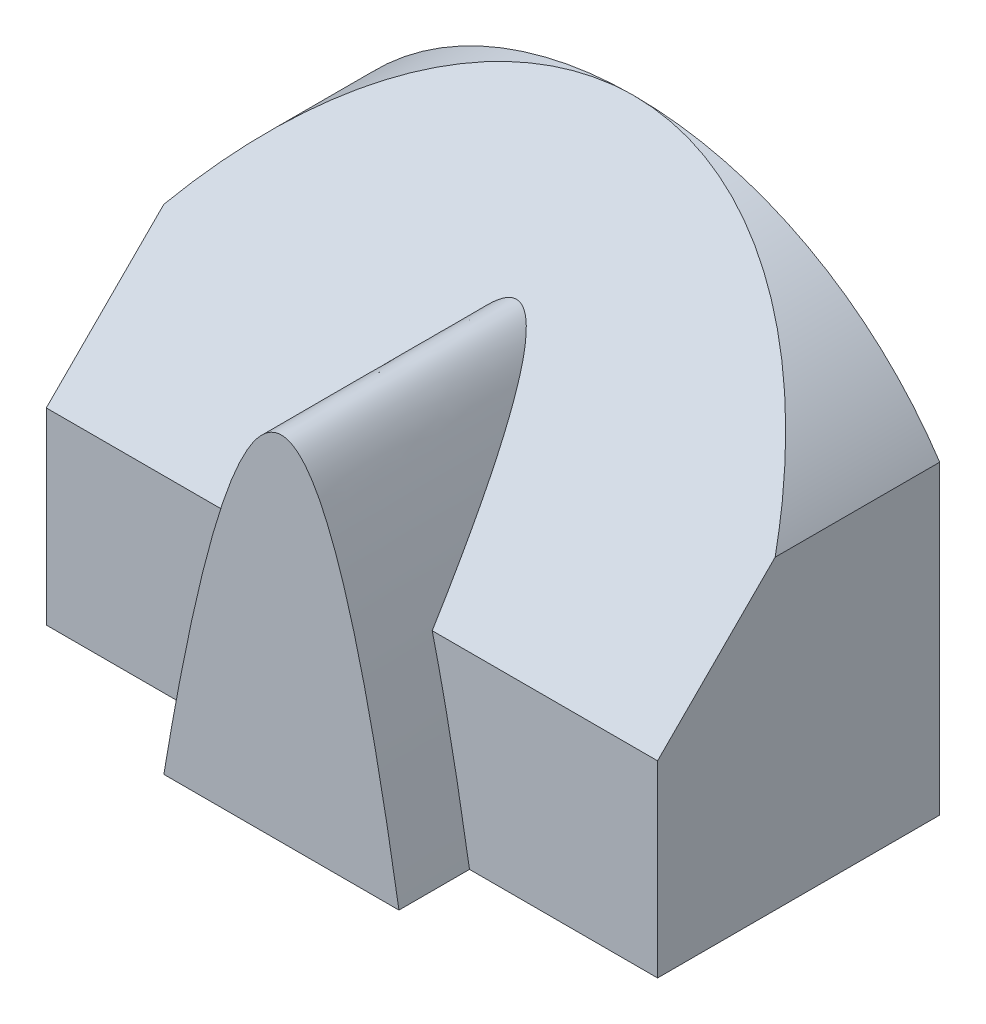
ISO-10303-21;
HEADER;
FILE_DESCRIPTION(('STEP AP214'),'2;1');
FILE_NAME('part.step','',(''),(''),'','','');
FILE_SCHEMA(('AUTOMOTIVE_DESIGN { 1 0 10303 214 1 1 1 1 }'));
ENDSEC;
DATA;
#1=APPLICATION_CONTEXT('core data for automotive mechanical design processes');
#2=APPLICATION_PROTOCOL_DEFINITION('international standard','automotive_design',2000,#1);
#3=PRODUCT_CONTEXT('',#1,'mechanical');
#4=PRODUCT('Part','Part','',(#3));
#5=PRODUCT_RELATED_PRODUCT_CATEGORY('part','',(#4));
#6=PRODUCT_DEFINITION_FORMATION('','',#4);
#7=PRODUCT_DEFINITION_CONTEXT('part definition',#1,'design');
#8=PRODUCT_DEFINITION('design','',#6,#7);
#9=PRODUCT_DEFINITION_SHAPE('','',#8);
#10=(LENGTH_UNIT() NAMED_UNIT(*) SI_UNIT(.MILLI.,.METRE.));
#11=(NAMED_UNIT(*) PLANE_ANGLE_UNIT() SI_UNIT($,.RADIAN.));
#12=(NAMED_UNIT(*) SI_UNIT($,.STERADIAN.) SOLID_ANGLE_UNIT());
#13=UNCERTAINTY_MEASURE_WITH_UNIT(LENGTH_MEASURE(1.E-05),#10,'distance_accuracy_value','');
#14=(GEOMETRIC_REPRESENTATION_CONTEXT(3) GLOBAL_UNCERTAINTY_ASSIGNED_CONTEXT((#13)) GLOBAL_UNIT_ASSIGNED_CONTEXT((#10,
#11,#12)) REPRESENTATION_CONTEXT('',''));
#15=CARTESIAN_POINT('',(0.,0.,0.));
#16=DIRECTION('',(0.,0.,1.));
#17=DIRECTION('',(1.,0.,0.));
#18=AXIS2_PLACEMENT_3D('',#15,#16,#17);
#19=CARTESIAN_POINT('',(0.,100.,0.));
#20=DIRECTION('',(0.,0.,-1.));
#21=DIRECTION('',(-1.,0.,0.));
#22=AXIS2_PLACEMENT_3D('',#19,#20,#21);
#23=PLANE('',#22);
#24=CARTESIAN_POINT('',(1355.99444873713,-199925.,0.));
#25=CARTESIAN_POINT('',(64.9999999986677,200075.,0.));
#26=CARTESIAN_POINT('',(-1225.99444873447,-199925.,0.));
#27=B_SPLINE_CURVE_WITH_KNOTS('',2,(#24,#25,#26),.UNSPECIFIED.,.F.,.F.,(3,3),(0.,1.),.UNSPECIFIED.);
#28=CARTESIAN_POINT('',(90.,0.,0.));
#29=VERTEX_POINT('',#28);
#30=CARTESIAN_POINT('',(82.0782512765948,40.,0.));
#31=VERTEX_POINT('',#30);
#32=EDGE_CURVE('E50',#29,#31,#27,.T.);
#33=ORIENTED_EDGE('',*,*,#32,.F.);
#34=DIRECTION('',(1.,0.,0.));
#35=VECTOR('',#34,1.);
#36=CARTESIAN_POINT('',(0.,0.,0.));
#37=LINE('',#36,#35);
#38=CARTESIAN_POINT('',(130.,0.,0.));
#39=VERTEX_POINT('',#38);
#40=EDGE_CURVE('E150',#29,#39,#37,.T.);
#41=ORIENTED_EDGE('',*,*,#40,.T.);
#42=DIRECTION('',(0.,1.,0.));
#43=VECTOR('',#42,1.);
#44=CARTESIAN_POINT('',(130.,0.,0.));
#45=LINE('',#44,#43);
#46=CARTESIAN_POINT('',(130.,40.,0.));
#47=VERTEX_POINT('',#46);
#48=EDGE_CURVE('E152',#39,#47,#45,.T.);
#49=ORIENTED_EDGE('',*,*,#48,.T.);
#50=DIRECTION('',(1.,0.,0.));
#51=VECTOR('',#50,1.);
#52=CARTESIAN_POINT('',(0.,40.,0.));
#53=LINE('',#52,#51);
#54=EDGE_CURVE('E135',#31,#47,#53,.T.);
#55=ORIENTED_EDGE('',*,*,#54,.F.);
#56=EDGE_LOOP('',(#33,#41,#49,#55));
#57=FACE_BOUND('',#56,.T.);
#58=ADVANCED_FACE('F30',(#57),#23,.F.);
#59=CARTESIAN_POINT('',(47.9217487234054,39.9999999999999,0.));
#60=VERTEX_POINT('',#59);
#61=CARTESIAN_POINT('',(40.,0.,0.));
#62=VERTEX_POINT('',#61);
#63=EDGE_CURVE('E120',#60,#62,#27,.T.);
#64=ORIENTED_EDGE('',*,*,#63,.F.);
#65=CARTESIAN_POINT('',(0.,40.,0.));
#66=VERTEX_POINT('',#65);
#67=EDGE_CURVE('E136',#66,#60,#53,.T.);
#68=ORIENTED_EDGE('',*,*,#67,.F.);
#69=DIRECTION('',(0.,-1.,0.));
#70=VECTOR('',#69,1.);
#71=CARTESIAN_POINT('',(0.,0.,0.));
#72=LINE('',#71,#70);
#73=CARTESIAN_POINT('',(0.,0.,0.));
#74=VERTEX_POINT('',#73);
#75=EDGE_CURVE('E146',#66,#74,#72,.T.);
#76=ORIENTED_EDGE('',*,*,#75,.T.);
#77=EDGE_CURVE('E58',#74,#62,#37,.T.);
#78=ORIENTED_EDGE('',*,*,#77,.T.);
#79=EDGE_LOOP('',(#64,#68,#76,#78));
#80=FACE_BOUND('',#79,.T.);
#81=ADVANCED_FACE('F193',(#80),#23,.F.);
#82=CARTESIAN_POINT('',(0.,40.,0.));
#83=DIRECTION('',(0.,-0.707106781186547,-0.707106781186548));
#84=DIRECTION('',(0.,0.707106781186548,-0.707106781186547));
#85=AXIS2_PLACEMENT_3D('',#82,#83,#84);
#86=PLANE('',#85);
#87=CARTESIAN_POINT('',(82.0782512765948,40.0000000000004,0.));
#88=CARTESIAN_POINT('',(81.9394076010281,40.5690652231404,-0.569065223140225));
#89=CARTESIAN_POINT('',(81.7989308451484,41.1379321636951,-1.13793216369506));
#90=CARTESIAN_POINT('',(81.5143614052626,42.2755414066527,-2.27554140665272));
#91=CARTESIAN_POINT('',(81.370266744169,42.844283461693,-2.84428346169306));
#92=CARTESIAN_POINT('',(81.0782040630542,43.9815210742126,-3.98152107421255));
#93=CARTESIAN_POINT('',(80.9302344175088,44.5500164231543,-4.55001642315425));
#94=CARTESIAN_POINT('',(80.6301182172563,45.6866320713027,-5.68663207130275));
#95=CARTESIAN_POINT('',(80.4779704256707,46.2547522073337,-6.25475220733373));
#96=CARTESIAN_POINT('',(80.1691513509301,47.3904834012959,-7.3904834012959));
#97=CARTESIAN_POINT('',(80.0124792631676,47.9580943499344,-7.95809434993444));
#98=CARTESIAN_POINT('',(79.6942090786773,49.092665715651,-9.09266571565098));
#99=CARTESIAN_POINT('',(79.5326106506704,49.6596260863079,-9.65962608630792));
#100=CARTESIAN_POINT('',(79.2007067171921,50.8041629623934,-10.8041629623934));
#101=CARTESIAN_POINT('',(79.0302914465827,51.3817235722529,-11.3817235722529));
#102=CARTESIAN_POINT('',(78.6832490600873,52.5358567827792,-12.5358567827792));
#103=CARTESIAN_POINT('',(78.5066225154146,53.1124294692115,-13.1124294692114));
#104=CARTESIAN_POINT('',(78.1464467354901,54.2644045010577,-14.2644045010578));
#105=CARTESIAN_POINT('',(77.9628985326279,54.8398070076205,-14.8398070076209));
#106=CARTESIAN_POINT('',(77.5880172575126,55.9892351293024,-15.9892351293021));
#107=CARTESIAN_POINT('',(77.3966856048037,56.563260975453,-16.5632609754517));
#108=CARTESIAN_POINT('',(77.0051734405386,57.7096955323516,-17.7096955323529));
#109=CARTESIAN_POINT('',(76.8049945212338,58.2821045145188,-18.2821045145237));
#110=CARTESIAN_POINT('',(76.3944555461301,59.4250264792013,-19.4250264791964));
#111=CARTESIAN_POINT('',(76.184096747222,59.9955396865361,-19.9955396865178));
#112=CARTESIAN_POINT('',(75.8386471890264,60.9048441438415,-20.9048441438297));
#113=CARTESIAN_POINT('',(75.7073871570479,61.2443638669723,-21.2443638669692));
#114=CARTESIAN_POINT('',(75.4401662307156,61.9224952757694,-21.9224952757726));
#115=CARTESIAN_POINT('',(75.3042051252435,62.2611069199174,-22.2611069199183));
#116=CARTESIAN_POINT('',(75.0270437571106,62.9373122131368,-22.9373122131359));
#117=CARTESIAN_POINT('',(74.8858427224606,63.27490570422,-23.2749057042197));
#118=CARTESIAN_POINT('',(74.5975486758207,63.9489418733196,-23.9489418733198));
#119=CARTESIAN_POINT('',(74.4504539625309,64.285384188165,-24.2853841881651));
#120=CARTESIAN_POINT('',(74.1495733622425,64.956954823527,-24.956954823527));
#121=CARTESIAN_POINT('',(73.9957842183821,65.2920824160146,-25.2920824160146));
#122=CARTESIAN_POINT('',(73.6813487752288,65.9590557570852,-25.9590557570852));
#123=CARTESIAN_POINT('',(73.5207364207926,66.2909094867718,-26.2909094867718));
#124=CARTESIAN_POINT('',(73.1908438566731,66.9524755910257,-26.9524755910257));
#125=CARTESIAN_POINT('',(73.0215633364035,67.2821878883865,-27.2821878883865));
#126=CARTESIAN_POINT('',(72.6729265637176,67.9387913172644,-27.9387913172644));
#127=CARTESIAN_POINT('',(72.4935745744914,68.2656835758888,-28.2656835758888));
#128=CARTESIAN_POINT('',(72.1229025472214,68.9158322168029,-28.9158322168029));
#129=CARTESIAN_POINT('',(71.9315901089056,69.239090756956,-29.239090756956));
#130=CARTESIAN_POINT('',(71.5343703670718,69.8809837463807,-29.8809837463806));
#131=CARTESIAN_POINT('',(71.3284687881813,70.1996199509273,-30.1996199509272));
#132=CARTESIAN_POINT('',(70.9690832296538,70.7268970326306,-30.7268970326304));
#133=CARTESIAN_POINT('',(70.8206303899345,70.9372494237751,-30.9372494237751));
#134=CARTESIAN_POINT('',(70.5139296118128,71.3544155508288,-31.3544155508288));
#135=CARTESIAN_POINT('',(70.3556799621754,71.5612286604236,-31.5612286604236));
#136=CARTESIAN_POINT('',(70.0275008509226,71.9701447101166,-31.9701447101166));
#137=CARTESIAN_POINT('',(69.8575745285604,72.172248896786,-32.172248896786));
#138=CARTESIAN_POINT('',(69.5919668738365,72.4705964591677,-32.4705964591677));
#139=CARTESIAN_POINT('',(69.5016546495646,72.5692341119763,-32.5692341119763));
#140=CARTESIAN_POINT('',(69.317028932421,72.7646150807421,-32.7646150807421));
#141=CARTESIAN_POINT('',(69.2227157090672,72.8613585236588,-32.8613585236589));
#142=CARTESIAN_POINT('',(69.0131343286279,73.0689043517104,-33.0689043517106));
#143=CARTESIAN_POINT('',(68.8970360145826,73.1792898255557,-33.1792898255557));
#144=CARTESIAN_POINT('',(68.6578093609994,73.3961688554086,-33.3961688554086));
#145=CARTESIAN_POINT('',(68.5346825026958,73.5026632237473,-33.5026632237473));
#146=CARTESIAN_POINT('',(68.28034898815,73.7106575228751,-33.710657522875));
#147=CARTESIAN_POINT('',(68.1491461428602,73.8121597693124,-33.8121597693123));
#148=CARTESIAN_POINT('',(67.8773908419128,74.0086913481374,-34.0086913481375));
#149=CARTESIAN_POINT('',(67.7368426546039,74.1037235960038,-34.1037235960042));
#150=CARTESIAN_POINT('',(67.4997346586655,74.251153649035,-34.2511536490353));
#151=CARTESIAN_POINT('',(67.4064479791363,74.306173510145,-34.3061735101451));
#152=CARTESIAN_POINT('',(67.2153900188837,74.4121433012828,-34.4121433012827));
#153=CARTESIAN_POINT('',(67.1176182884366,74.4630928217601,-34.46309282176));
#154=CARTESIAN_POINT('',(66.8172842256318,74.6084940572538,-34.6084940572538));
#155=CARTESIAN_POINT('',(66.6072961479366,74.6957605007558,-34.6957605007558));
#156=CARTESIAN_POINT('',(66.3051875063318,74.7964020815529,-34.7964020815529));
#157=CARTESIAN_POINT('',(66.2210243032,74.8219683817759,-34.8219683817759));
#158=CARTESIAN_POINT('',(66.0502155544215,74.868519789213,-34.868519789213));
#159=CARTESIAN_POINT('',(65.9635712849979,74.8895072054968,-34.8895072054967));
#160=CARTESIAN_POINT('',(65.7882171773896,74.926367026077,-34.926367026077));
#161=CARTESIAN_POINT('',(65.6995095020778,74.9422445485473,-34.9422445485472));
#162=CARTESIAN_POINT('',(65.5204580701717,74.968456198776,-34.9684561987759));
#163=CARTESIAN_POINT('',(65.4301143322326,74.9787903897011,-34.9787903897011));
#164=CARTESIAN_POINT('',(65.247852905127,74.993631256263,-34.993631256263));
#165=CARTESIAN_POINT('',(65.1559287277269,74.9980984516754,-34.9980984516754));
#166=CARTESIAN_POINT('',(64.9718938815529,75.0009212311295,-35.0009212311295));
#167=CARTESIAN_POINT('',(64.8797832174935,74.9992769677948,-34.9992769677948));
#168=CARTESIAN_POINT('',(64.6961297661519,74.9899320445076,-34.9899320445076));
#169=CARTESIAN_POINT('',(64.6045873342053,74.9822279174797,-34.9822279174797));
#170=CARTESIAN_POINT('',(64.4228609004799,74.9610206663784,-34.9610206663784));
#171=CARTESIAN_POINT('',(64.3326770511322,74.9475168965353,-34.9475168965354));
#172=CARTESIAN_POINT('',(64.1411988690007,74.912750011557,-34.9127500115571));
#173=CARTESIAN_POINT('',(64.0402120996256,74.8906400479065,-34.8906400479065));
#174=CARTESIAN_POINT('',(63.8414698058593,74.8401236594022,-34.8401236594022));
#175=CARTESIAN_POINT('',(63.7437148807362,74.8117160742467,-34.8117160742466));
#176=CARTESIAN_POINT('',(63.4555681597696,74.7181972168166,-34.7181972168166));
#177=CARTESIAN_POINT('',(63.2704855440326,74.644827239288,-34.644827239288));
#178=CARTESIAN_POINT('',(62.9436315517705,74.4952446017428,-34.4952446017428));
#179=CARTESIAN_POINT('',(62.7996573691995,74.4213465316505,-34.4213465316505));
#180=CARTESIAN_POINT('',(62.5211984963753,74.2649900768133,-34.2649900768133));
#181=CARTESIAN_POINT('',(62.3867211723504,74.1825251670932,-34.1825251670932));
#182=CARTESIAN_POINT('',(62.1260851655298,74.0109171833381,-34.0109171833381));
#183=CARTESIAN_POINT('',(61.999946881353,73.9217587957416,-33.9217587957416));
#184=CARTESIAN_POINT('',(61.7553106914991,73.7384327257852,-33.7384327257852));
#185=CARTESIAN_POINT('',(61.6368103733336,73.6442666424512,-33.6442666424512));
#186=CARTESIAN_POINT('',(61.4038852387207,73.4498186983081,-33.4498186983081));
#187=CARTESIAN_POINT('',(61.2896110856585,73.3494471103692,-33.3494471103692));
#188=CARTESIAN_POINT('',(61.0671253763685,73.1453842388652,-33.1453842388652));
#189=CARTESIAN_POINT('',(60.9589149761918,73.041692328164,-33.041692328164));
#190=CARTESIAN_POINT('',(60.7476635465047,72.8314572857765,-32.8314572857765));
#191=CARTESIAN_POINT('',(60.6446314386662,72.7249096876103,-32.7249096876103));
#192=CARTESIAN_POINT('',(60.4433027281701,72.5095952673065,-32.5095952673064));
#193=CARTESIAN_POINT('',(60.3450065738465,72.4008282364459,-32.4008282364458));
#194=CARTESIAN_POINT('',(60.0562631310125,72.0715979409704,-32.0715979409703));
#195=CARTESIAN_POINT('',(59.8721191767114,71.8483659255889,-31.8483659255888));
#196=CARTESIAN_POINT('',(59.516305899322,71.3953027410538,-31.3953027410538));
#197=CARTESIAN_POINT('',(59.3447176073123,71.1654401326238,-31.1654401326238));
#198=CARTESIAN_POINT('',(59.0129997806243,70.7019952062484,-30.7019952062484));
#199=CARTESIAN_POINT('',(58.8528561664637,70.4684179065015,-30.4684179065014));
#200=CARTESIAN_POINT('',(58.5420511465768,69.9982803967749,-29.998280396775));
#201=CARTESIAN_POINT('',(58.3913853201312,69.761721640174,-29.7617216401742));
#202=CARTESIAN_POINT('',(58.0444102474754,69.1991943704766,-29.1991943704768));
#203=CARTESIAN_POINT('',(57.8515560505491,68.8721617879566,-28.8721617879567));
#204=CARTESIAN_POINT('',(57.478053071375,68.2146161004819,-28.2146161004819));
#205=CARTESIAN_POINT('',(57.2974054903416,67.8841026566752,-27.8841026566751));
#206=CARTESIAN_POINT('',(56.9461889426417,67.2200383603552,-27.2200383603552));
#207=CARTESIAN_POINT('',(56.7756303079092,66.8864847844228,-26.8864847844228));
#208=CARTESIAN_POINT('',(56.4432817960093,66.2172205570568,-26.2172205570568));
#209=CARTESIAN_POINT('',(56.2814916179104,65.8815099800939,-25.8815099800939));
#210=CARTESIAN_POINT('',(55.9652491388711,65.2077971965723,-25.2077971965723));
#211=CARTESIAN_POINT('',(55.8108084866738,64.8697922627463,-24.8697922627463));
#212=CARTESIAN_POINT('',(55.5085824654099,64.1922984731249,-24.1922984731249));
#213=CARTESIAN_POINT('',(55.3607971453706,63.8528096064181,-23.8528096064181));
#214=CARTESIAN_POINT('',(55.0709770742766,63.1722627832964,-23.1722627832963));
#215=CARTESIAN_POINT('',(54.9289478255369,62.8312036571403,-22.8312036571403));
#216=CARTESIAN_POINT('',(54.6501534142291,62.1480099722222,-22.1480099722222));
#217=CARTESIAN_POINT('',(54.5133883062557,61.8058754023464,-21.8058754023464));
#218=CARTESIAN_POINT('',(54.1101928873881,60.7781406876277,-20.7781406876277));
#219=CARTESIAN_POINT('',(53.8508374284853,60.0911501897447,-20.0911501897447));
#220=CARTESIAN_POINT('',(53.347722921499,58.7145108068649,-18.7145108068649));
#221=CARTESIAN_POINT('',(53.1039602140775,58.0248625861669,-18.0248625861669));
#222=CARTESIAN_POINT('',(52.629790878847,56.6440872584351,-16.6440872584351));
#223=CARTESIAN_POINT('',(52.3993697762273,55.9529626309257,-15.9529626309256));
#224=CARTESIAN_POINT('',(51.949871395936,54.5693516656849,-14.5693516656849));
#225=CARTESIAN_POINT('',(51.7307868089881,53.8768665118545,-13.8768665118546));
#226=CARTESIAN_POINT('',(51.302395926744,52.4905794868962,-12.4905794868961));
#227=CARTESIAN_POINT('',(51.0930870771767,51.7967780095692,-11.7967780095689));
#228=CARTESIAN_POINT('',(50.6829963447933,50.407853970148,-10.4078539701483));
#229=CARTESIAN_POINT('',(50.4822152154159,49.7127312969687,-9.71273129696986));
#230=CARTESIAN_POINT('',(50.1789874926643,48.6418629718586,-8.6418629718592));
#231=CARTESIAN_POINT('',(50.0738477026933,48.2664971488527,-8.26649714885286));
#232=CARTESIAN_POINT('',(49.8656319126139,47.5154097033138,-7.51540970331366));
#233=CARTESIAN_POINT('',(49.7625562840597,47.1396880292499,-7.13968802924983));
#234=CARTESIAN_POINT('',(49.5583575574138,46.3879323193677,-6.38793231936776));
#235=CARTESIAN_POINT('',(49.4572346981206,46.0118982511391,-6.01189825113908));
#236=CARTESIAN_POINT('',(49.2568412791899,45.259559231629,-5.25955923162896));
#237=CARTESIAN_POINT('',(49.1575708353134,44.8832542649346,-4.88325426493458));
#238=CARTESIAN_POINT('',(48.961106799818,44.1316227971141,-4.13162279711414));
#239=CARTESIAN_POINT('',(48.8639075635704,43.7562970334222,-3.75629703342222));
#240=CARTESIAN_POINT('',(48.6711762207738,43.005455873173,-3.00545587317302));
#241=CARTESIAN_POINT('',(48.5756440102514,42.6299404899564,-2.62994048995642));
#242=CARTESIAN_POINT('',(48.3861708224601,41.8787587610864,-1.87875876108643));
#243=CARTESIAN_POINT('',(48.2922296429442,41.5030924409299,-1.50309244092984));
#244=CARTESIAN_POINT('',(48.1058703262961,40.7516464186227,-0.751646418622754));
#245=CARTESIAN_POINT('',(48.0134518958381,40.3758667528497,-0.375866752849771));
#246=CARTESIAN_POINT('',(47.9217487234054,39.9999999999997,0.));
#247=B_SPLINE_CURVE_WITH_KNOTS('',3,(#87,#88,#89,#90,#91,#92,#93,#94,#95,#96,#97,#98,#99,#100,
#101,#102,#103,#104,#105,#106,#107,#108,#109,#110,#111,#112,#113,#114,#115,#116,#117,#118,#119,
#120,#121,#122,#123,#124,#125,#126,#127,#128,#129,#130,#131,#132,#133,#134,#135,#136,#137,#138,
#139,#140,#141,#142,#143,#144,#145,#146,#147,#148,#149,#150,#151,#152,#153,#154,#155,#156,#157,
#158,#159,#160,#161,#162,#163,#164,#165,#166,#167,#168,#169,#170,#171,#172,#173,#174,#175,#176,
#177,#178,#179,#180,#181,#182,#183,#184,#185,#186,#187,#188,#189,#190,#191,#192,#193,#194,#195,
#196,#197,#198,#199,#200,#201,#202,#203,#204,#205,#206,#207,#208,#209,#210,#211,#212,#213,#214,
#215,#216,#217,#218,#219,#220,#221,#222,#223,#224,#225,#226,#227,#228,#229,#230,#231,#232,#233,
#234,#235,#236,#237,#238,#239,#240,#241,#242,#243,#244,#245,#246),.UNSPECIFIED.,.F.,.F.,(4,2,2,
2,2,2,2,2,2,2,2,2,2,2,2,2,2,2,2,2,2,2,2,2,2,2,2,2,2,2,2,2,2,2,2,2,2,2,2,2,2,2,2,2,2,2,2,2,2,2,2,
2,2,2,2,2,2,2,2,2,2,2,2,2,2,2,2,2,2,2,2,2,2,2,2,2,2,2,2,4),(0.,2.45000683137347,
4.90138298991779,7.35380449551198,9.8069600017898,12.2605545008217,14.7143143610448,
17.2174395400949,19.7203351207906,22.2228588510127,24.7249281998307,27.2265490678881,
29.7278618496019,31.2211565877292,32.7145184748486,34.2081012565448,35.70211833445,
37.1968705624753,38.6849012253877,40.172985242797,41.6604440433396,43.1469671266247,
44.6329101098634,45.6301650755443,46.6275947286098,47.6247572657445,48.1232341022102,
48.6216774130946,49.2051475464447,49.7884951668076,50.3715695926112,50.954379513068,
51.3185960361126,51.6828491599423,52.409714380307,52.684317741836,52.9587823028372,
53.2329710927173,53.5071567581311,53.7831781792921,54.0591927073189,54.3353652685839,
54.6115685886544,54.9282302999166,55.2449504028963,55.8789780017755,56.4120079519782,
56.9454469057291,57.4801458264039,58.0146750237472,58.5611727433574,59.1077743004371,
59.6552874007302,60.2028522304858,61.2988107192312,62.4013116674088,63.502432076124,
64.6030350223295,66.1060829241823,67.6092785214516,69.1139877767785,70.6186453580826,
72.1256133354185,73.6325924122458,75.1409795981897,76.6493824234579,79.6659253529484,
82.6817577370338,85.6942543361346,88.7047837716556,91.7145221438247,94.7245258806963,
96.3480002829725,97.9717643346291,99.5957257101689,101.219788232576,102.838636582732,
104.457383600923,106.075923280837,107.69414744944),.UNSPECIFIED.);
#248=EDGE_CURVE('E11',#31,#60,#247,.T.);
#249=ORIENTED_EDGE('',*,*,#248,.F.);
#250=ORIENTED_EDGE('',*,*,#54,.T.);
#251=DIRECTION('',(0.,0.707106781186548,-0.707106781186547));
#252=VECTOR('',#251,1.);
#253=CARTESIAN_POINT('',(130.,40.,0.));
#254=LINE('',#253,#252);
#255=CARTESIAN_POINT('',(130.,65.,-25.));
#256=VERTEX_POINT('',#255);
#257=EDGE_CURVE('E127',#47,#256,#254,.T.);
#258=ORIENTED_EDGE('',*,*,#257,.T.);
#259=CARTESIAN_POINT('',(65.,22.1428571428572,17.8571428571428));
#260=DIRECTION('',(0.,-0.707106781186547,-0.707106781186548));
#261=DIRECTION('',(0.,-0.707106781186548,0.707106781186547));
#262=AXIS2_PLACEMENT_3D('',#259,#260,#261);
#263=ELLIPSE('',#262,110.106627356191,77.8571428571428);
#264=CARTESIAN_POINT('',(65.,100.,-60.));
#265=VERTEX_POINT('',#264);
#266=EDGE_CURVE('E167',#265,#256,#263,.T.);
#267=ORIENTED_EDGE('',*,*,#266,.F.);
#268=CARTESIAN_POINT('',(0.,65.,-25.));
#269=VERTEX_POINT('',#268);
#270=EDGE_CURVE('E43',#269,#265,#263,.T.);
#271=ORIENTED_EDGE('',*,*,#270,.F.);
#272=DIRECTION('',(0.,0.707106781186548,-0.707106781186547));
#273=VECTOR('',#272,1.);
#274=CARTESIAN_POINT('',(0.,40.,0.));
#275=LINE('',#274,#273);
#276=EDGE_CURVE('E132',#66,#269,#275,.T.);
#277=ORIENTED_EDGE('',*,*,#276,.F.);
#278=ORIENTED_EDGE('',*,*,#67,.T.);
#279=EDGE_LOOP('',(#249,#250,#258,#267,#271,#277,#278));
#280=FACE_BOUND('',#279,.T.);
#281=ADVANCED_FACE('F191',(#280),#86,.F.);
#282=CARTESIAN_POINT('',(65.,22.1428571428572,-60.));
#283=DIRECTION('',(0.,0.,1.));
#284=DIRECTION('',(1.,0.,0.));
#285=AXIS2_PLACEMENT_3D('',#282,#283,#284);
#286=CYLINDRICAL_SURFACE('',#285,77.8571428571428);
#287=DIRECTION('',(0.,0.,1.));
#288=VECTOR('',#287,1.);
#289=CARTESIAN_POINT('',(0.,65.,-60.));
#290=LINE('',#289,#288);
#291=CARTESIAN_POINT('',(0.,65.,-60.));
#292=VERTEX_POINT('',#291);
#293=EDGE_CURVE('E143',#292,#269,#290,.T.);
#294=ORIENTED_EDGE('',*,*,#293,.T.);
#295=ORIENTED_EDGE('',*,*,#270,.T.);
#296=CARTESIAN_POINT('',(65.,22.1428571428572,-60.));
#297=DIRECTION('',(0.,0.,-1.));
#298=DIRECTION('',(1.,0.,0.));
#299=AXIS2_PLACEMENT_3D('',#296,#297,#298);
#300=CIRCLE('',#299,77.8571428571428);
#301=EDGE_CURVE('E139',#292,#265,#300,.T.);
#302=ORIENTED_EDGE('',*,*,#301,.F.);
#303=EDGE_LOOP('',(#294,#295,#302));
#304=FACE_BOUND('',#303,.T.);
#305=ADVANCED_FACE('F175',(#304),#286,.T.);
#306=CARTESIAN_POINT('',(0.,0.,-60.));
#307=DIRECTION('',(-1.,0.,0.));
#308=DIRECTION('',(0.,0.,1.));
#309=AXIS2_PLACEMENT_3D('',#306,#307,#308);
#310=PLANE('',#309);
#311=ORIENTED_EDGE('',*,*,#276,.T.);
#312=ORIENTED_EDGE('',*,*,#293,.F.);
#313=DIRECTION('',(0.,-1.,0.));
#314=VECTOR('',#313,1.);
#315=CARTESIAN_POINT('',(0.,0.,-60.));
#316=LINE('',#315,#314);
#317=CARTESIAN_POINT('',(0.,0.,-60.));
#318=VERTEX_POINT('',#317);
#319=EDGE_CURVE('E155',#292,#318,#316,.T.);
#320=ORIENTED_EDGE('',*,*,#319,.T.);
#321=DIRECTION('',(0.,0.,1.));
#322=VECTOR('',#321,1.);
#323=CARTESIAN_POINT('',(0.,0.,-60.));
#324=LINE('',#323,#322);
#325=EDGE_CURVE('E163',#318,#74,#324,.T.);
#326=ORIENTED_EDGE('',*,*,#325,.T.);
#327=ORIENTED_EDGE('',*,*,#75,.F.);
#328=EDGE_LOOP('',(#311,#312,#320,#326,#327));
#329=FACE_BOUND('',#328,.T.);
#330=ADVANCED_FACE('F32',(#329),#310,.T.);
#331=CARTESIAN_POINT('',(130.,0.,-60.));
#332=DIRECTION('',(1.,0.,0.));
#333=DIRECTION('',(0.,0.,-1.));
#334=AXIS2_PLACEMENT_3D('',#331,#332,#333);
#335=PLANE('',#334);
#336=ORIENTED_EDGE('',*,*,#257,.F.);
#337=ORIENTED_EDGE('',*,*,#48,.F.);
#338=DIRECTION('',(0.,0.,1.));
#339=VECTOR('',#338,1.);
#340=CARTESIAN_POINT('',(130.,0.,-60.));
#341=LINE('',#340,#339);
#342=CARTESIAN_POINT('',(130.,0.,-60.));
#343=VERTEX_POINT('',#342);
#344=EDGE_CURVE('E164',#343,#39,#341,.T.);
#345=ORIENTED_EDGE('',*,*,#344,.F.);
#346=DIRECTION('',(0.,1.,0.));
#347=VECTOR('',#346,1.);
#348=CARTESIAN_POINT('',(130.,0.,-60.));
#349=LINE('',#348,#347);
#350=CARTESIAN_POINT('',(130.,65.,-60.));
#351=VERTEX_POINT('',#350);
#352=EDGE_CURVE('E160',#343,#351,#349,.T.);
#353=ORIENTED_EDGE('',*,*,#352,.T.);
#354=DIRECTION('',(0.,0.,1.));
#355=VECTOR('',#354,1.);
#356=CARTESIAN_POINT('',(130.,65.,-60.));
#357=LINE('',#356,#355);
#358=EDGE_CURVE('E142',#351,#256,#357,.T.);
#359=ORIENTED_EDGE('',*,*,#358,.T.);
#360=EDGE_LOOP('',(#336,#337,#345,#353,#359));
#361=FACE_BOUND('',#360,.T.);
#362=ADVANCED_FACE('F190',(#361),#335,.T.);
#363=CARTESIAN_POINT('',(0.,0.,-60.));
#364=DIRECTION('',(0.,-1.,0.));
#365=DIRECTION('',(0.,0.,-1.));
#366=AXIS2_PLACEMENT_3D('',#363,#364,#365);
#367=PLANE('',#366);
#368=DIRECTION('',(0.,0.,-1.));
#369=VECTOR('',#368,1.);
#370=CARTESIAN_POINT('',(40.,0.,15.));
#371=LINE('',#370,#369);
#372=CARTESIAN_POINT('',(40.,0.,15.));
#373=VERTEX_POINT('',#372);
#374=EDGE_CURVE('E109',#373,#62,#371,.T.);
#375=ORIENTED_EDGE('',*,*,#374,.T.);
#376=ORIENTED_EDGE('',*,*,#77,.F.);
#377=ORIENTED_EDGE('',*,*,#325,.F.);
#378=DIRECTION('',(1.,0.,0.));
#379=VECTOR('',#378,1.);
#380=CARTESIAN_POINT('',(0.,0.,-60.));
#381=LINE('',#380,#379);
#382=EDGE_CURVE('E157',#318,#343,#381,.T.);
#383=ORIENTED_EDGE('',*,*,#382,.T.);
#384=ORIENTED_EDGE('',*,*,#344,.T.);
#385=ORIENTED_EDGE('',*,*,#40,.F.);
#386=DIRECTION('',(0.,0.,-1.));
#387=VECTOR('',#386,1.);
#388=CARTESIAN_POINT('',(90.,0.,15.));
#389=LINE('',#388,#387);
#390=CARTESIAN_POINT('',(90.,0.,15.));
#391=VERTEX_POINT('',#390);
#392=EDGE_CURVE('E111',#391,#29,#389,.T.);
#393=ORIENTED_EDGE('',*,*,#392,.F.);
#394=DIRECTION('',(1.,0.,0.));
#395=VECTOR('',#394,1.);
#396=CARTESIAN_POINT('',(40.,0.,15.));
#397=LINE('',#396,#395);
#398=EDGE_CURVE('E105',#373,#391,#397,.T.);
#399=ORIENTED_EDGE('',*,*,#398,.F.);
#400=EDGE_LOOP('',(#375,#376,#377,#383,#384,#385,#393,#399));
#401=FACE_BOUND('',#400,.T.);
#402=ADVANCED_FACE('F107',(#401),#367,.T.);
#403=CARTESIAN_POINT('',(0.,100.,-60.));
#404=DIRECTION('',(0.,0.,-1.));
#405=DIRECTION('',(-1.,0.,0.));
#406=AXIS2_PLACEMENT_3D('',#403,#404,#405);
#407=PLANE('',#406);
#408=ORIENTED_EDGE('',*,*,#301,.T.);
#409=EDGE_CURVE('E138',#265,#351,#300,.T.);
#410=ORIENTED_EDGE('',*,*,#409,.T.);
#411=ORIENTED_EDGE('',*,*,#352,.F.);
#412=ORIENTED_EDGE('',*,*,#382,.F.);
#413=ORIENTED_EDGE('',*,*,#319,.F.);
#414=EDGE_LOOP('',(#408,#410,#411,#412,#413));
#415=FACE_BOUND('',#414,.T.);
#416=ADVANCED_FACE('F182',(#415),#407,.T.);
#417=ORIENTED_EDGE('',*,*,#409,.F.);
#418=ORIENTED_EDGE('',*,*,#266,.T.);
#419=ORIENTED_EDGE('',*,*,#358,.F.);
#420=EDGE_LOOP('',(#417,#418,#419));
#421=FACE_BOUND('',#420,.T.);
#422=ADVANCED_FACE('F178',(#421),#286,.T.);
#423=CARTESIAN_POINT('',(1355.99444873713,-199925.,15.));
#424=CARTESIAN_POINT('',(64.9999999986677,200075.,15.));
#425=CARTESIAN_POINT('',(-1225.99444873447,-199925.,15.));
#426=B_SPLINE_CURVE_WITH_KNOTS('',2,(#423,#424,#425),.UNSPECIFIED.,.F.,.F.,(3,3),(0.,1.),.UNSPECIFIED.);
#427=DIRECTION('',(0.,0.,-1.));
#428=VECTOR('',#427,1.);
#429=SURFACE_OF_LINEAR_EXTRUSION('',#426,#428);
#430=ORIENTED_EDGE('',*,*,#392,.T.);
#431=ORIENTED_EDGE('',*,*,#32,.T.);
#432=ORIENTED_EDGE('',*,*,#248,.T.);
#433=ORIENTED_EDGE('',*,*,#63,.T.);
#434=ORIENTED_EDGE('',*,*,#374,.F.);
#435=EDGE_CURVE('E114',#391,#373,#426,.T.);
#436=ORIENTED_EDGE('',*,*,#435,.F.);
#437=EDGE_LOOP('',(#430,#431,#432,#433,#434,#436));
#438=FACE_BOUND('',#437,.T.);
#439=ADVANCED_FACE('F119',(#438),#429,.F.);
#440=CARTESIAN_POINT('',(64.9999999999999,74.9999999999815,15.));
#441=DIRECTION('',(0.,0.,1.));
#442=DIRECTION('',(1.,0.,0.));
#443=AXIS2_PLACEMENT_3D('',#440,#441,#442);
#444=PLANE('',#443);
#445=ORIENTED_EDGE('',*,*,#435,.T.);
#446=ORIENTED_EDGE('',*,*,#398,.T.);
#447=EDGE_LOOP('',(#445,#446));
#448=FACE_BOUND('',#447,.T.);
#449=ADVANCED_FACE('F116',(#448),#444,.T.);
#450=CLOSED_SHELL('',(#58,#81,#281,#305,#330,#362,#402,#416,#422,#439,#449));
#451=MANIFOLD_SOLID_BREP('B2',#450);
#452=ADVANCED_BREP_SHAPE_REPRESENTATION('',(#18,#451),#14);
#453=SHAPE_DEFINITION_REPRESENTATION(#9,#452);
ENDSEC;
END-ISO-10303-21;
